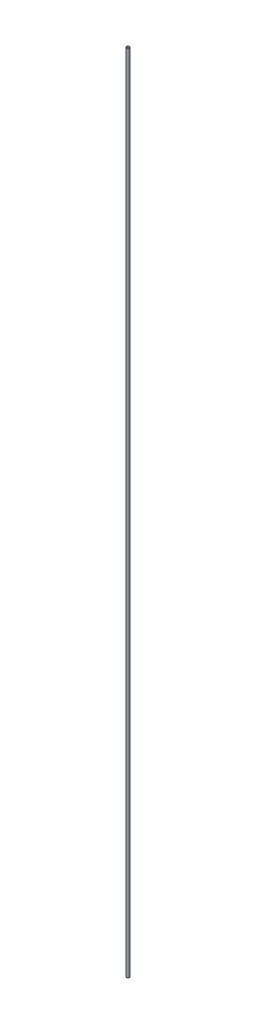
ISO-10303-21;
HEADER;
FILE_DESCRIPTION(('STEP AP214'),'2;1');
FILE_NAME('part.step','',(''),(''),'','','');
FILE_SCHEMA(('AUTOMOTIVE_DESIGN { 1 0 10303 214 1 1 1 1 }'));
ENDSEC;
DATA;
#1=APPLICATION_CONTEXT('core data for automotive mechanical design processes');
#2=APPLICATION_PROTOCOL_DEFINITION('international standard','automotive_design',2000,#1);
#3=PRODUCT_CONTEXT('',#1,'mechanical');
#4=PRODUCT('Part','Part','',(#3));
#5=PRODUCT_RELATED_PRODUCT_CATEGORY('part','',(#4));
#6=PRODUCT_DEFINITION_FORMATION('','',#4);
#7=PRODUCT_DEFINITION_CONTEXT('part definition',#1,'design');
#8=PRODUCT_DEFINITION('design','',#6,#7);
#9=PRODUCT_DEFINITION_SHAPE('','',#8);
#10=(LENGTH_UNIT() NAMED_UNIT(*) SI_UNIT(.MILLI.,.METRE.));
#11=(NAMED_UNIT(*) PLANE_ANGLE_UNIT() SI_UNIT($,.RADIAN.));
#12=(NAMED_UNIT(*) SI_UNIT($,.STERADIAN.) SOLID_ANGLE_UNIT());
#13=UNCERTAINTY_MEASURE_WITH_UNIT(LENGTH_MEASURE(1.E-05),#10,'distance_accuracy_value','');
#14=(GEOMETRIC_REPRESENTATION_CONTEXT(3) GLOBAL_UNCERTAINTY_ASSIGNED_CONTEXT((#13)) GLOBAL_UNIT_ASSIGNED_CONTEXT((#10,
#11,#12)) REPRESENTATION_CONTEXT('',''));
#15=CARTESIAN_POINT('',(0.,0.,0.));
#16=DIRECTION('',(0.,0.,1.));
#17=DIRECTION('',(1.,0.,0.));
#18=AXIS2_PLACEMENT_3D('',#15,#16,#17);
#19=CARTESIAN_POINT('',(0.,0.,0.));
#20=DIRECTION('',(0.,-1.,0.));
#21=DIRECTION('',(0.,0.,-1.));
#22=AXIS2_PLACEMENT_3D('',#19,#20,#21);
#23=CYLINDRICAL_SURFACE('',#22,3.175);
#24=CARTESIAN_POINT('',(0.,-1828.8,-2.23963406628068E-13));
#25=DIRECTION('',(0.,1.,0.));
#26=DIRECTION('',(0.,0.,1.));
#27=AXIS2_PLACEMENT_3D('',#24,#25,#26);
#28=CIRCLE('',#27,3.175);
#29=CARTESIAN_POINT('',(0.,-1828.8,3.17499999999978));
#30=VERTEX_POINT('',#29);
#31=EDGE_CURVE('E51',#30,#30,#28,.T.);
#32=ORIENTED_EDGE('',*,*,#31,.T.);
#33=EDGE_LOOP('',(#32));
#34=FACE_BOUND('',#33,.T.);
#35=CARTESIAN_POINT('',(0.,0.,0.));
#36=DIRECTION('',(0.,1.,0.));
#37=DIRECTION('',(0.,0.,1.));
#38=AXIS2_PLACEMENT_3D('',#35,#36,#37);
#39=CIRCLE('',#38,3.175);
#40=CARTESIAN_POINT('',(0.,0.,3.175));
#41=VERTEX_POINT('',#40);
#42=EDGE_CURVE('E40',#41,#41,#39,.T.);
#43=ORIENTED_EDGE('',*,*,#42,.F.);
#44=EDGE_LOOP('',(#43));
#45=FACE_BOUND('',#44,.T.);
#46=ADVANCED_FACE('F37',(#34,#45),#23,.T.);
#47=CARTESIAN_POINT('',(0.,0.,0.));
#48=DIRECTION('',(0.,1.,0.));
#49=DIRECTION('',(0.,0.,1.));
#50=AXIS2_PLACEMENT_3D('',#47,#48,#49);
#51=PLANE('',#50);
#52=CARTESIAN_POINT('',(0.,0.,0.));
#53=DIRECTION('',(0.,1.,0.));
#54=DIRECTION('',(0.,0.,1.));
#55=AXIS2_PLACEMENT_3D('',#52,#53,#54);
#56=CIRCLE('',#55,3.0269571570865);
#57=CARTESIAN_POINT('',(0.,0.,3.0269571570865));
#58=VERTEX_POINT('',#57);
#59=EDGE_CURVE('E45',#58,#58,#56,.F.);
#60=ORIENTED_EDGE('',*,*,#59,.T.);
#61=EDGE_LOOP('',(#60));
#62=FACE_BOUND('',#61,.T.);
#63=ORIENTED_EDGE('',*,*,#42,.T.);
#64=EDGE_LOOP('',(#63));
#65=FACE_BOUND('',#64,.T.);
#66=ADVANCED_FACE('F61',(#62,#65),#51,.T.);
#67=CARTESIAN_POINT('',(0.,-1828.8,-2.23963406628068E-13));
#68=DIRECTION('',(0.,1.,0.));
#69=DIRECTION('',(0.,0.,1.));
#70=AXIS2_PLACEMENT_3D('',#67,#68,#69);
#71=PLANE('',#70);
#72=CARTESIAN_POINT('',(0.,-1828.8,-2.23963406628068E-13));
#73=DIRECTION('',(0.,1.,0.));
#74=DIRECTION('',(0.,0.,1.));
#75=AXIS2_PLACEMENT_3D('',#72,#73,#74);
#76=CIRCLE('',#75,3.0269571570865);
#77=CARTESIAN_POINT('',(0.,-1828.8,3.02695715708628));
#78=VERTEX_POINT('',#77);
#79=EDGE_CURVE('E10',#78,#78,#76,.F.);
#80=ORIENTED_EDGE('',*,*,#79,.F.);
#81=EDGE_LOOP('',(#80));
#82=FACE_BOUND('',#81,.T.);
#83=ORIENTED_EDGE('',*,*,#31,.F.);
#84=EDGE_LOOP('',(#83));
#85=FACE_BOUND('',#84,.T.);
#86=ADVANCED_FACE('F67',(#82,#85),#71,.F.);
#87=CARTESIAN_POINT('',(0.,0.,0.));
#88=DIRECTION('',(0.,-1.,0.));
#89=DIRECTION('',(0.,0.,-1.));
#90=AXIS2_PLACEMENT_3D('',#87,#88,#89);
#91=CYLINDRICAL_SURFACE('',#90,3.0269571570865);
#92=ORIENTED_EDGE('',*,*,#79,.T.);
#93=EDGE_LOOP('',(#92));
#94=FACE_BOUND('',#93,.T.);
#95=ORIENTED_EDGE('',*,*,#59,.F.);
#96=EDGE_LOOP('',(#95));
#97=FACE_BOUND('',#96,.T.);
#98=ADVANCED_FACE('F69',(#94,#97),#91,.F.);
#99=CLOSED_SHELL('',(#46,#66,#86,#98));
#100=MANIFOLD_SOLID_BREP('B2',#99);
#101=ADVANCED_BREP_SHAPE_REPRESENTATION('',(#18,#100),#14);
#102=SHAPE_DEFINITION_REPRESENTATION(#9,#101);
ENDSEC;
END-ISO-10303-21;
